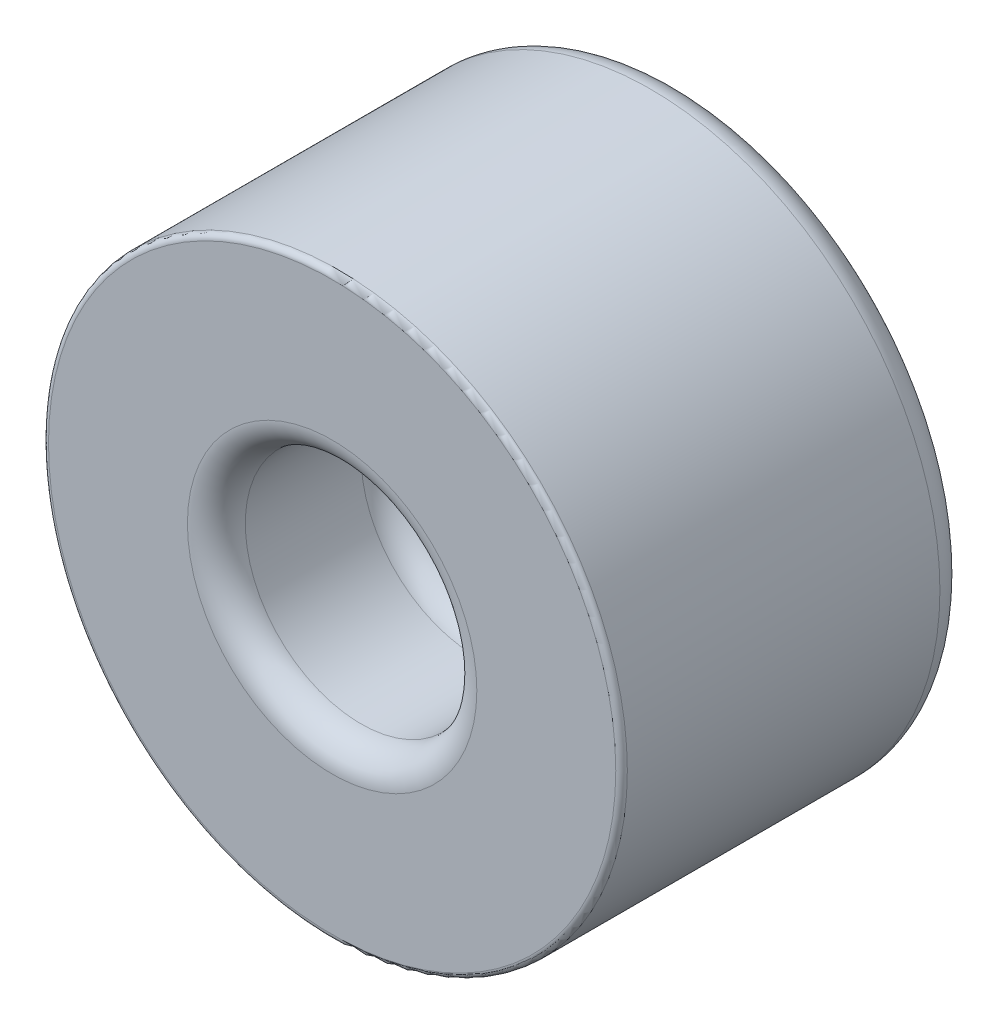
ISO-10303-21;
HEADER;
FILE_DESCRIPTION(('STEP AP214'),'2;1');
FILE_NAME('part.step','',(''),(''),'','','');
FILE_SCHEMA(('AUTOMOTIVE_DESIGN { 1 0 10303 214 1 1 1 1 }'));
ENDSEC;
DATA;
#1=APPLICATION_CONTEXT('core data for automotive mechanical design processes');
#2=APPLICATION_PROTOCOL_DEFINITION('international standard','automotive_design',2000,#1);
#3=PRODUCT_CONTEXT('',#1,'mechanical');
#4=PRODUCT('Part','Part','',(#3));
#5=PRODUCT_RELATED_PRODUCT_CATEGORY('part','',(#4));
#6=PRODUCT_DEFINITION_FORMATION('','',#4);
#7=PRODUCT_DEFINITION_CONTEXT('part definition',#1,'design');
#8=PRODUCT_DEFINITION('design','',#6,#7);
#9=PRODUCT_DEFINITION_SHAPE('','',#8);
#10=(LENGTH_UNIT() NAMED_UNIT(*) SI_UNIT(.MILLI.,.METRE.));
#11=(NAMED_UNIT(*) PLANE_ANGLE_UNIT() SI_UNIT($,.RADIAN.));
#12=(NAMED_UNIT(*) SI_UNIT($,.STERADIAN.) SOLID_ANGLE_UNIT());
#13=UNCERTAINTY_MEASURE_WITH_UNIT(LENGTH_MEASURE(1.E-05),#10,'distance_accuracy_value','');
#14=(GEOMETRIC_REPRESENTATION_CONTEXT(3) GLOBAL_UNCERTAINTY_ASSIGNED_CONTEXT((#13)) GLOBAL_UNIT_ASSIGNED_CONTEXT((#10,
#11,#12)) REPRESENTATION_CONTEXT('',''));
#15=CARTESIAN_POINT('',(0.,0.,0.));
#16=DIRECTION('',(0.,0.,1.));
#17=DIRECTION('',(1.,0.,0.));
#18=AXIS2_PLACEMENT_3D('',#15,#16,#17);
#19=CARTESIAN_POINT('',(0.,0.,6.));
#20=DIRECTION('',(0.,0.,-1.));
#21=DIRECTION('',(-1.,0.,0.));
#22=AXIS2_PLACEMENT_3D('',#19,#20,#21);
#23=CYLINDRICAL_SURFACE('',#22,5.);
#24=CARTESIAN_POINT('',(0.,0.,5.9));
#25=DIRECTION('',(0.,0.,1.));
#26=DIRECTION('',(1.,0.,0.));
#27=AXIS2_PLACEMENT_3D('',#24,#25,#26);
#28=CIRCLE('',#27,5.);
#29=CARTESIAN_POINT('',(5.,0.,5.9));
#30=VERTEX_POINT('',#29);
#31=EDGE_CURVE('E10',#30,#30,#28,.F.);
#32=ORIENTED_EDGE('',*,*,#31,.T.);
#33=EDGE_LOOP('',(#32));
#34=FACE_BOUND('',#33,.T.);
#35=CARTESIAN_POINT('',(0.,0.,0.5));
#36=DIRECTION('',(0.,0.,1.));
#37=DIRECTION('',(1.,0.,0.));
#38=AXIS2_PLACEMENT_3D('',#35,#36,#37);
#39=CIRCLE('',#38,5.);
#40=CARTESIAN_POINT('',(5.,0.,0.5));
#41=VERTEX_POINT('',#40);
#42=EDGE_CURVE('E62',#41,#41,#39,.T.);
#43=ORIENTED_EDGE('',*,*,#42,.T.);
#44=EDGE_LOOP('',(#43));
#45=FACE_BOUND('',#44,.T.);
#46=ADVANCED_FACE('F33',(#34,#45),#23,.T.);
#47=CARTESIAN_POINT('',(0.,0.,6.));
#48=DIRECTION('',(0.,0.,1.));
#49=DIRECTION('',(1.,0.,0.));
#50=AXIS2_PLACEMENT_3D('',#47,#48,#49);
#51=PLANE('',#50);
#52=CARTESIAN_POINT('',(0.,0.,6.));
#53=DIRECTION('',(0.,0.,1.));
#54=DIRECTION('',(1.,0.,0.));
#55=AXIS2_PLACEMENT_3D('',#52,#53,#54);
#56=CIRCLE('',#55,4.9);
#57=CARTESIAN_POINT('',(4.9,0.,6.));
#58=VERTEX_POINT('',#57);
#59=EDGE_CURVE('E40',#58,#58,#56,.T.);
#60=ORIENTED_EDGE('',*,*,#59,.T.);
#61=EDGE_LOOP('',(#60));
#62=FACE_BOUND('',#61,.T.);
#63=CARTESIAN_POINT('',(0.,0.,6.));
#64=DIRECTION('',(0.,0.,1.));
#65=DIRECTION('',(1.,0.,0.));
#66=AXIS2_PLACEMENT_3D('',#63,#64,#65);
#67=CIRCLE('',#66,2.5);
#68=CARTESIAN_POINT('',(2.5,0.,6.));
#69=VERTEX_POINT('',#68);
#70=EDGE_CURVE('E48',#69,#69,#67,.F.);
#71=ORIENTED_EDGE('',*,*,#70,.T.);
#72=EDGE_LOOP('',(#71));
#73=FACE_BOUND('',#72,.T.);
#74=ADVANCED_FACE('F86',(#62,#73),#51,.T.);
#75=CARTESIAN_POINT('',(0.,0.,0.));
#76=DIRECTION('',(0.,0.,1.));
#77=DIRECTION('',(1.,0.,0.));
#78=AXIS2_PLACEMENT_3D('',#75,#76,#77);
#79=PLANE('',#78);
#80=CARTESIAN_POINT('',(0.,0.,0.));
#81=DIRECTION('',(0.,0.,1.));
#82=DIRECTION('',(1.,0.,0.));
#83=AXIS2_PLACEMENT_3D('',#80,#81,#82);
#84=CIRCLE('',#83,4.5);
#85=CARTESIAN_POINT('',(4.5,0.,0.));
#86=VERTEX_POINT('',#85);
#87=EDGE_CURVE('E59',#86,#86,#84,.F.);
#88=ORIENTED_EDGE('',*,*,#87,.T.);
#89=EDGE_LOOP('',(#88));
#90=FACE_BOUND('',#89,.T.);
#91=ADVANCED_FACE('F90',(#90),#79,.F.);
#92=CARTESIAN_POINT('',(0.,0.,3.));
#93=DIRECTION('',(0.,0.,1.));
#94=DIRECTION('',(1.,0.,0.));
#95=AXIS2_PLACEMENT_3D('',#92,#93,#94);
#96=CYLINDRICAL_SURFACE('',#95,2.);
#97=CARTESIAN_POINT('',(0.,0.,5.5));
#98=DIRECTION('',(0.,0.,1.));
#99=DIRECTION('',(1.,0.,0.));
#100=AXIS2_PLACEMENT_3D('',#97,#98,#99);
#101=CIRCLE('',#100,2.);
#102=CARTESIAN_POINT('',(2.,0.,5.5));
#103=VERTEX_POINT('',#102);
#104=EDGE_CURVE('E53',#103,#103,#101,.T.);
#105=ORIENTED_EDGE('',*,*,#104,.T.);
#106=EDGE_LOOP('',(#105));
#107=FACE_BOUND('',#106,.T.);
#108=CARTESIAN_POINT('',(0.,0.,3.5));
#109=DIRECTION('',(0.,0.,1.));
#110=DIRECTION('',(1.,0.,0.));
#111=AXIS2_PLACEMENT_3D('',#108,#109,#110);
#112=CIRCLE('',#111,2.);
#113=CARTESIAN_POINT('',(2.,0.,3.5));
#114=VERTEX_POINT('',#113);
#115=EDGE_CURVE('E56',#114,#114,#112,.F.);
#116=ORIENTED_EDGE('',*,*,#115,.T.);
#117=EDGE_LOOP('',(#116));
#118=FACE_BOUND('',#117,.T.);
#119=ADVANCED_FACE('F80',(#107,#118),#96,.F.);
#120=CARTESIAN_POINT('',(0.,0.,3.));
#121=DIRECTION('',(0.,0.,1.));
#122=DIRECTION('',(1.,0.,0.));
#123=AXIS2_PLACEMENT_3D('',#120,#121,#122);
#124=PLANE('',#123);
#125=CARTESIAN_POINT('',(0.,0.,3.));
#126=DIRECTION('',(0.,0.,1.));
#127=DIRECTION('',(1.,0.,0.));
#128=AXIS2_PLACEMENT_3D('',#125,#126,#127);
#129=CIRCLE('',#128,1.5);
#130=CARTESIAN_POINT('',(1.5,0.,3.));
#131=VERTEX_POINT('',#130);
#132=EDGE_CURVE('E44',#131,#131,#129,.T.);
#133=ORIENTED_EDGE('',*,*,#132,.T.);
#134=EDGE_LOOP('',(#133));
#135=FACE_BOUND('',#134,.T.);
#136=ADVANCED_FACE('F70',(#135),#124,.T.);
#137=CARTESIAN_POINT('',(0.,0.,0.5));
#138=DIRECTION('',(0.,0.,1.));
#139=DIRECTION('',(1.,0.,0.));
#140=AXIS2_PLACEMENT_3D('',#137,#138,#139);
#141=TOROIDAL_SURFACE('',#140,4.5,0.5);
#142=ORIENTED_EDGE('',*,*,#87,.F.);
#143=EDGE_LOOP('',(#142));
#144=FACE_BOUND('',#143,.T.);
#145=ORIENTED_EDGE('',*,*,#42,.F.);
#146=EDGE_LOOP('',(#145));
#147=FACE_BOUND('',#146,.T.);
#148=ADVANCED_FACE('F67',(#144,#147),#141,.T.);
#149=CARTESIAN_POINT('',(0.,0.,5.5));
#150=DIRECTION('',(0.,0.,1.));
#151=DIRECTION('',(1.,0.,0.));
#152=AXIS2_PLACEMENT_3D('',#149,#150,#151);
#153=TOROIDAL_SURFACE('',#152,2.5,0.5);
#154=ORIENTED_EDGE('',*,*,#70,.F.);
#155=EDGE_LOOP('',(#154));
#156=FACE_BOUND('',#155,.T.);
#157=ORIENTED_EDGE('',*,*,#104,.F.);
#158=EDGE_LOOP('',(#157));
#159=FACE_BOUND('',#158,.T.);
#160=ADVANCED_FACE('F69',(#156,#159),#153,.T.);
#161=CARTESIAN_POINT('',(0.,0.,3.5));
#162=DIRECTION('',(0.,0.,1.));
#163=DIRECTION('',(1.,0.,0.));
#164=AXIS2_PLACEMENT_3D('',#161,#162,#163);
#165=TOROIDAL_SURFACE('',#164,1.5,0.5);
#166=ORIENTED_EDGE('',*,*,#115,.F.);
#167=EDGE_LOOP('',(#166));
#168=FACE_BOUND('',#167,.T.);
#169=ORIENTED_EDGE('',*,*,#132,.F.);
#170=EDGE_LOOP('',(#169));
#171=FACE_BOUND('',#170,.T.);
#172=ADVANCED_FACE('F77',(#168,#171),#165,.F.);
#173=CARTESIAN_POINT('',(0.,0.,5.9));
#174=DIRECTION('',(0.,0.,1.));
#175=DIRECTION('',(1.,0.,0.));
#176=AXIS2_PLACEMENT_3D('',#173,#174,#175);
#177=TOROIDAL_SURFACE('',#176,4.9,0.1);
#178=ORIENTED_EDGE('',*,*,#31,.F.);
#179=EDGE_LOOP('',(#178));
#180=FACE_BOUND('',#179,.T.);
#181=ORIENTED_EDGE('',*,*,#59,.F.);
#182=EDGE_LOOP('',(#181));
#183=FACE_BOUND('',#182,.T.);
#184=ADVANCED_FACE('F35',(#180,#183),#177,.T.);
#185=CLOSED_SHELL('',(#46,#74,#91,#119,#136,#148,#160,#172,#184));
#186=MANIFOLD_SOLID_BREP('B2',#185);
#187=ADVANCED_BREP_SHAPE_REPRESENTATION('',(#18,#186),#14);
#188=SHAPE_DEFINITION_REPRESENTATION(#9,#187);
ENDSEC;
END-ISO-10303-21;
